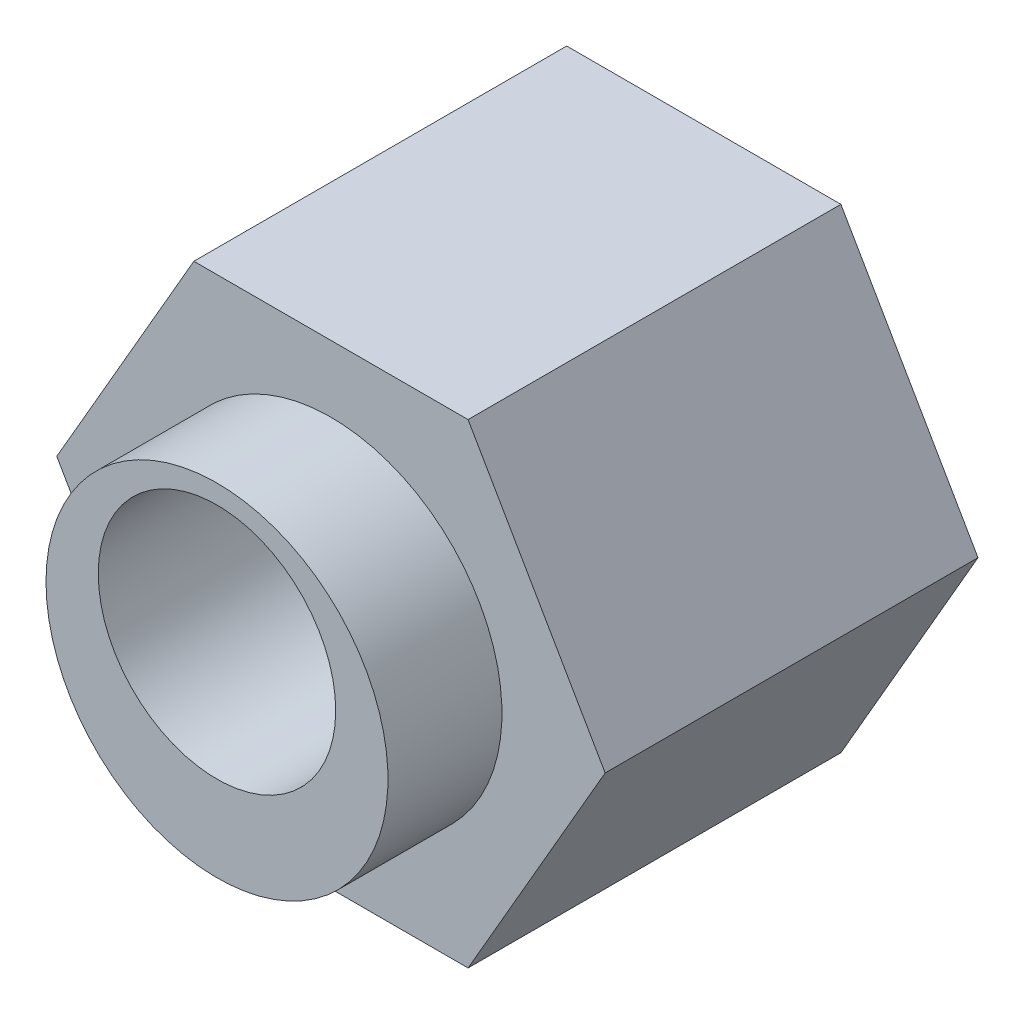
ISO-10303-21;
HEADER;
FILE_DESCRIPTION(('STEP AP214'),'2;1');
FILE_NAME('part.step','',(''),(''),'','','');
FILE_SCHEMA(('AUTOMOTIVE_DESIGN { 1 0 10303 214 1 1 1 1 }'));
ENDSEC;
DATA;
#1=APPLICATION_CONTEXT('core data for automotive mechanical design processes');
#2=APPLICATION_PROTOCOL_DEFINITION('international standard','automotive_design',2000,#1);
#3=PRODUCT_CONTEXT('',#1,'mechanical');
#4=PRODUCT('Part','Part','',(#3));
#5=PRODUCT_RELATED_PRODUCT_CATEGORY('part','',(#4));
#6=PRODUCT_DEFINITION_FORMATION('','',#4);
#7=PRODUCT_DEFINITION_CONTEXT('part definition',#1,'design');
#8=PRODUCT_DEFINITION('design','',#6,#7);
#9=PRODUCT_DEFINITION_SHAPE('','',#8);
#10=(LENGTH_UNIT() NAMED_UNIT(*) SI_UNIT(.MILLI.,.METRE.));
#11=(NAMED_UNIT(*) PLANE_ANGLE_UNIT() SI_UNIT($,.RADIAN.));
#12=(NAMED_UNIT(*) SI_UNIT($,.STERADIAN.) SOLID_ANGLE_UNIT());
#13=UNCERTAINTY_MEASURE_WITH_UNIT(LENGTH_MEASURE(1.E-05),#10,'distance_accuracy_value','');
#14=(GEOMETRIC_REPRESENTATION_CONTEXT(3) GLOBAL_UNCERTAINTY_ASSIGNED_CONTEXT((#13)) GLOBAL_UNIT_ASSIGNED_CONTEXT((#10,
#11,#12)) REPRESENTATION_CONTEXT('',''));
#15=CARTESIAN_POINT('',(0.,0.,0.));
#16=DIRECTION('',(0.,0.,1.));
#17=DIRECTION('',(1.,0.,0.));
#18=AXIS2_PLACEMENT_3D('',#15,#16,#17);
#19=CARTESIAN_POINT('',(0.,0.7,0.45));
#20=DIRECTION('',(0.,0.,-1.));
#21=DIRECTION('',(-1.,0.,0.));
#22=AXIS2_PLACEMENT_3D('',#19,#20,#21);
#23=PLANE('',#22);
#24=CARTESIAN_POINT('',(0.,0.7,0.45));
#25=DIRECTION('',(0.,0.,-1.));
#26=DIRECTION('',(-1.,0.,0.));
#27=AXIS2_PLACEMENT_3D('',#24,#25,#26);
#28=CIRCLE('',#27,3.6);
#29=CARTESIAN_POINT('',(-3.6,0.7,0.45));
#30=VERTEX_POINT('',#29);
#31=EDGE_CURVE('E19',#30,#30,#28,.T.);
#32=ORIENTED_EDGE('',*,*,#31,.F.);
#33=EDGE_LOOP('',(#32));
#34=FACE_BOUND('',#33,.T.);
#35=DIRECTION('',(0.5,-0.866025403784439,0.));
#36=VECTOR('',#35,1.);
#37=CARTESIAN_POINT('',(-5.77350269189626,0.,0.45));
#38=LINE('',#37,#36);
#39=CARTESIAN_POINT('',(-5.77350269189626,0.,0.45));
#40=VERTEX_POINT('',#39);
#41=CARTESIAN_POINT('',(-2.88675134594813,-5.,0.45));
#42=VERTEX_POINT('',#41);
#43=EDGE_CURVE('E67',#40,#42,#38,.T.);
#44=ORIENTED_EDGE('',*,*,#43,.F.);
#45=DIRECTION('',(-0.500000000000001,-0.866025403784438,0.));
#46=VECTOR('',#45,1.);
#47=CARTESIAN_POINT('',(-2.88675134594812,5.,0.45));
#48=LINE('',#47,#46);
#49=CARTESIAN_POINT('',(-2.88675134594813,5.,0.45));
#50=VERTEX_POINT('',#49);
#51=EDGE_CURVE('E74',#50,#40,#48,.T.);
#52=ORIENTED_EDGE('',*,*,#51,.F.);
#53=DIRECTION('',(1.,0.,0.));
#54=VECTOR('',#53,1.);
#55=CARTESIAN_POINT('',(2.88675134594813,5.,0.45));
#56=LINE('',#55,#54);
#57=CARTESIAN_POINT('',(2.88675134594813,5.,0.45));
#58=VERTEX_POINT('',#57);
#59=EDGE_CURVE('E123',#58,#50,#56,.F.);
#60=ORIENTED_EDGE('',*,*,#59,.F.);
#61=DIRECTION('',(-0.5,0.866025403784439,0.));
#62=VECTOR('',#61,1.);
#63=CARTESIAN_POINT('',(5.77350269189626,0.,0.45));
#64=LINE('',#63,#62);
#65=CARTESIAN_POINT('',(5.77350269189626,0.,0.45));
#66=VERTEX_POINT('',#65);
#67=EDGE_CURVE('E128',#66,#58,#64,.T.);
#68=ORIENTED_EDGE('',*,*,#67,.F.);
#69=DIRECTION('',(0.500000000000001,0.866025403784438,0.));
#70=VECTOR('',#69,1.);
#71=CARTESIAN_POINT('',(2.88675134594812,-5.,0.45));
#72=LINE('',#71,#70);
#73=CARTESIAN_POINT('',(2.88675134594813,-5.,0.45));
#74=VERTEX_POINT('',#73);
#75=EDGE_CURVE('E133',#74,#66,#72,.T.);
#76=ORIENTED_EDGE('',*,*,#75,.F.);
#77=DIRECTION('',(1.,0.,0.));
#78=VECTOR('',#77,1.);
#79=CARTESIAN_POINT('',(-2.88675134594813,-5.,0.45));
#80=LINE('',#79,#78);
#81=EDGE_CURVE('E88',#42,#74,#80,.T.);
#82=ORIENTED_EDGE('',*,*,#81,.F.);
#83=EDGE_LOOP('',(#44,#52,#60,#68,#76,#82));
#84=FACE_BOUND('',#83,.T.);
#85=ADVANCED_FACE('F16',(#34,#84),#23,.T.);
#86=CARTESIAN_POINT('',(0.,0.7,0.45));
#87=DIRECTION('',(0.,0.,-1.));
#88=DIRECTION('',(-1.,0.,0.));
#89=AXIS2_PLACEMENT_3D('',#86,#87,#88);
#90=CYLINDRICAL_SURFACE('',#89,3.6);
#91=ORIENTED_EDGE('',*,*,#31,.T.);
#92=EDGE_LOOP('',(#91));
#93=FACE_BOUND('',#92,.T.);
#94=CARTESIAN_POINT('',(0.,0.7,0.0500000000442924));
#95=DIRECTION('',(0.,0.,1.));
#96=DIRECTION('',(1.,0.,0.));
#97=AXIS2_PLACEMENT_3D('',#94,#95,#96);
#98=CIRCLE('',#97,3.60000000000582);
#99=CARTESIAN_POINT('',(3.60000000000582,0.7,0.0500000000442924));
#100=VERTEX_POINT('',#99);
#101=EDGE_CURVE('E94',#100,#100,#98,.F.);
#102=ORIENTED_EDGE('',*,*,#101,.F.);
#103=EDGE_LOOP('',(#102));
#104=FACE_BOUND('',#103,.T.);
#105=ADVANCED_FACE('F273',(#93,#104),#90,.T.);
#106=CARTESIAN_POINT('',(-2.88675134594812,5.,-0.0499999999999997));
#107=DIRECTION('',(-0.866025403784438,0.500000000000001,0.));
#108=DIRECTION('',(-0.500000000000001,-0.866025403784438,0.));
#109=AXIS2_PLACEMENT_3D('',#106,#107,#108);
#110=PLANE('',#109);
#111=DIRECTION('',(0.,0.,1.));
#112=VECTOR('',#111,1.);
#113=CARTESIAN_POINT('',(-5.77350269189626,0.,-0.0499999999999997));
#114=LINE('',#113,#112);
#115=CARTESIAN_POINT('',(-5.77350269189626,0.,8.3));
#116=VERTEX_POINT('',#115);
#117=EDGE_CURVE('E77',#116,#40,#114,.F.);
#118=ORIENTED_EDGE('',*,*,#117,.F.);
#119=DIRECTION('',(-0.500000000000001,-0.866025403784438,0.));
#120=VECTOR('',#119,1.);
#121=CARTESIAN_POINT('',(-2.88675134594812,5.,8.3));
#122=LINE('',#121,#120);
#123=CARTESIAN_POINT('',(-2.88675134594813,5.,8.3));
#124=VERTEX_POINT('',#123);
#125=EDGE_CURVE('E96',#124,#116,#122,.T.);
#126=ORIENTED_EDGE('',*,*,#125,.F.);
#127=DIRECTION('',(0.,0.,1.));
#128=VECTOR('',#127,1.);
#129=CARTESIAN_POINT('',(-2.88675134594813,5.,-0.0499999999999997));
#130=LINE('',#129,#128);
#131=EDGE_CURVE('E79',#50,#124,#130,.T.);
#132=ORIENTED_EDGE('',*,*,#131,.F.);
#133=ORIENTED_EDGE('',*,*,#51,.T.);
#134=EDGE_LOOP('',(#118,#126,#132,#133));
#135=FACE_BOUND('',#134,.T.);
#136=ADVANCED_FACE('F75',(#135),#110,.T.);
#137=CARTESIAN_POINT('',(-5.77350269189626,0.,-0.0499999999999997));
#138=DIRECTION('',(-0.866025403784439,-0.5,0.));
#139=DIRECTION('',(0.5,-0.866025403784439,0.));
#140=AXIS2_PLACEMENT_3D('',#137,#138,#139);
#141=PLANE('',#140);
#142=DIRECTION('',(0.,0.,-1.));
#143=VECTOR('',#142,1.);
#144=CARTESIAN_POINT('',(-2.88675134594813,-5.,-0.0499999999999997));
#145=LINE('',#144,#143);
#146=CARTESIAN_POINT('',(-2.88675134594813,-5.,8.3));
#147=VERTEX_POINT('',#146);
#148=EDGE_CURVE('E89',#147,#42,#145,.T.);
#149=ORIENTED_EDGE('',*,*,#148,.F.);
#150=DIRECTION('',(0.5,-0.866025403784439,0.));
#151=VECTOR('',#150,1.);
#152=CARTESIAN_POINT('',(-5.77350269189626,0.,8.3));
#153=LINE('',#152,#151);
#154=EDGE_CURVE('E84',#116,#147,#153,.T.);
#155=ORIENTED_EDGE('',*,*,#154,.F.);
#156=ORIENTED_EDGE('',*,*,#117,.T.);
#157=ORIENTED_EDGE('',*,*,#43,.T.);
#158=EDGE_LOOP('',(#149,#155,#156,#157));
#159=FACE_BOUND('',#158,.T.);
#160=ADVANCED_FACE('F83',(#159),#141,.T.);
#161=CARTESIAN_POINT('',(-2.88675134594813,-5.,-0.0499999999999997));
#162=DIRECTION('',(0.,-1.,0.));
#163=DIRECTION('',(0.,0.,-1.));
#164=AXIS2_PLACEMENT_3D('',#161,#162,#163);
#165=PLANE('',#164);
#166=DIRECTION('',(0.,0.,1.));
#167=VECTOR('',#166,1.);
#168=CARTESIAN_POINT('',(2.88675134594812,-5.,-0.0499999999999997));
#169=LINE('',#168,#167);
#170=CARTESIAN_POINT('',(2.88675134594813,-5.,8.3));
#171=VERTEX_POINT('',#170);
#172=EDGE_CURVE('E135',#171,#74,#169,.F.);
#173=ORIENTED_EDGE('',*,*,#172,.F.);
#174=DIRECTION('',(1.,0.,0.));
#175=VECTOR('',#174,1.);
#176=CARTESIAN_POINT('',(0.,-5.,8.3));
#177=LINE('',#176,#175);
#178=EDGE_CURVE('E118',#147,#171,#177,.T.);
#179=ORIENTED_EDGE('',*,*,#178,.F.);
#180=ORIENTED_EDGE('',*,*,#148,.T.);
#181=ORIENTED_EDGE('',*,*,#81,.T.);
#182=EDGE_LOOP('',(#173,#179,#180,#181));
#183=FACE_BOUND('',#182,.T.);
#184=ADVANCED_FACE('F139',(#183),#165,.T.);
#185=CARTESIAN_POINT('',(2.88675134594812,-5.,-0.0499999999999997));
#186=DIRECTION('',(0.866025403784438,-0.500000000000001,0.));
#187=DIRECTION('',(0.500000000000001,0.866025403784438,0.));
#188=AXIS2_PLACEMENT_3D('',#185,#186,#187);
#189=PLANE('',#188);
#190=DIRECTION('',(0.,0.,1.));
#191=VECTOR('',#190,1.);
#192=CARTESIAN_POINT('',(5.77350269189626,0.,-0.0499999999999997));
#193=LINE('',#192,#191);
#194=CARTESIAN_POINT('',(5.77350269189626,0.,8.3));
#195=VERTEX_POINT('',#194);
#196=EDGE_CURVE('E130',#195,#66,#193,.F.);
#197=ORIENTED_EDGE('',*,*,#196,.F.);
#198=DIRECTION('',(0.500000000000001,0.866025403784438,0.));
#199=VECTOR('',#198,1.);
#200=CARTESIAN_POINT('',(2.88675134594812,-5.,8.3));
#201=LINE('',#200,#199);
#202=EDGE_CURVE('E113',#171,#195,#201,.T.);
#203=ORIENTED_EDGE('',*,*,#202,.F.);
#204=ORIENTED_EDGE('',*,*,#172,.T.);
#205=ORIENTED_EDGE('',*,*,#75,.T.);
#206=EDGE_LOOP('',(#197,#203,#204,#205));
#207=FACE_BOUND('',#206,.T.);
#208=ADVANCED_FACE('F144',(#207),#189,.T.);
#209=CARTESIAN_POINT('',(5.77350269189626,0.,-0.0499999999999997));
#210=DIRECTION('',(0.866025403784439,0.5,0.));
#211=DIRECTION('',(-0.5,0.866025403784439,0.));
#212=AXIS2_PLACEMENT_3D('',#209,#210,#211);
#213=PLANE('',#212);
#214=DIRECTION('',(0.,0.,1.));
#215=VECTOR('',#214,1.);
#216=CARTESIAN_POINT('',(2.88675134594813,5.,-0.0499999999999997));
#217=LINE('',#216,#215);
#218=CARTESIAN_POINT('',(2.88675134594813,5.,8.3));
#219=VERTEX_POINT('',#218);
#220=EDGE_CURVE('E125',#219,#58,#217,.F.);
#221=ORIENTED_EDGE('',*,*,#220,.F.);
#222=DIRECTION('',(-0.5,0.866025403784439,0.));
#223=VECTOR('',#222,1.);
#224=CARTESIAN_POINT('',(5.77350269189626,0.,8.3));
#225=LINE('',#224,#223);
#226=EDGE_CURVE('E34',#195,#219,#225,.T.);
#227=ORIENTED_EDGE('',*,*,#226,.F.);
#228=ORIENTED_EDGE('',*,*,#196,.T.);
#229=ORIENTED_EDGE('',*,*,#67,.T.);
#230=EDGE_LOOP('',(#221,#227,#228,#229));
#231=FACE_BOUND('',#230,.T.);
#232=ADVANCED_FACE('F147',(#231),#213,.T.);
#233=CARTESIAN_POINT('',(2.88675134594813,5.,-0.0499999999999997));
#234=DIRECTION('',(0.,1.,0.));
#235=DIRECTION('',(0.,0.,1.));
#236=AXIS2_PLACEMENT_3D('',#233,#234,#235);
#237=PLANE('',#236);
#238=ORIENTED_EDGE('',*,*,#131,.T.);
#239=DIRECTION('',(1.,0.,0.));
#240=VECTOR('',#239,1.);
#241=CARTESIAN_POINT('',(0.,5.,8.3));
#242=LINE('',#241,#240);
#243=EDGE_CURVE('E108',#219,#124,#242,.F.);
#244=ORIENTED_EDGE('',*,*,#243,.F.);
#245=ORIENTED_EDGE('',*,*,#220,.T.);
#246=ORIENTED_EDGE('',*,*,#59,.T.);
#247=EDGE_LOOP('',(#238,#244,#245,#246));
#248=FACE_BOUND('',#247,.T.);
#249=ADVANCED_FACE('F149',(#248),#237,.T.);
#250=CARTESIAN_POINT('',(0.,0.7,0.0500000000442924));
#251=DIRECTION('',(0.,0.,1.));
#252=DIRECTION('',(1.,0.,0.));
#253=AXIS2_PLACEMENT_3D('',#250,#251,#252);
#254=CONICAL_SURFACE('',#253,3.60000000000582,0.785398163397448);
#255=CARTESIAN_POINT('',(0.,0.7,-0.049999999987449));
#256=DIRECTION('',(0.,0.,1.));
#257=DIRECTION('',(1.,0.,0.));
#258=AXIS2_PLACEMENT_3D('',#255,#256,#257);
#259=CIRCLE('',#258,3.49999999997408);
#260=CARTESIAN_POINT('',(3.49999999997408,0.7,-0.049999999987449));
#261=VERTEX_POINT('',#260);
#262=EDGE_CURVE('E106',#261,#261,#259,.T.);
#263=ORIENTED_EDGE('',*,*,#262,.T.);
#264=EDGE_LOOP('',(#263));
#265=FACE_BOUND('',#264,.T.);
#266=ORIENTED_EDGE('',*,*,#101,.T.);
#267=EDGE_LOOP('',(#266));
#268=FACE_BOUND('',#267,.T.);
#269=ADVANCED_FACE('F151',(#265,#268),#254,.T.);
#270=CARTESIAN_POINT('',(0.,0.,8.3));
#271=DIRECTION('',(0.,0.,1.));
#272=DIRECTION('',(1.,0.,0.));
#273=AXIS2_PLACEMENT_3D('',#270,#271,#272);
#274=PLANE('',#273);
#275=ORIENTED_EDGE('',*,*,#226,.T.);
#276=ORIENTED_EDGE('',*,*,#243,.T.);
#277=ORIENTED_EDGE('',*,*,#125,.T.);
#278=ORIENTED_EDGE('',*,*,#154,.T.);
#279=ORIENTED_EDGE('',*,*,#178,.T.);
#280=ORIENTED_EDGE('',*,*,#202,.T.);
#281=EDGE_LOOP('',(#275,#276,#277,#278,#279,#280));
#282=FACE_BOUND('',#281,.T.);
#283=CARTESIAN_POINT('',(0.,0.,8.3));
#284=DIRECTION('',(0.,0.,-1.));
#285=DIRECTION('',(-1.,0.,0.));
#286=AXIS2_PLACEMENT_3D('',#283,#284,#285);
#287=CIRCLE('',#286,3.6);
#288=CARTESIAN_POINT('',(-3.6,0.,8.3));
#289=VERTEX_POINT('',#288);
#290=EDGE_CURVE('E104',#289,#289,#287,.F.);
#291=ORIENTED_EDGE('',*,*,#290,.F.);
#292=EDGE_LOOP('',(#291));
#293=FACE_BOUND('',#292,.T.);
#294=ADVANCED_FACE('F158',(#282,#293),#274,.T.);
#295=CARTESIAN_POINT('',(0.,0.,-0.0499999999999997));
#296=DIRECTION('',(0.,0.,1.));
#297=DIRECTION('',(1.,0.,0.));
#298=AXIS2_PLACEMENT_3D('',#295,#296,#297);
#299=PLANE('',#298);
#300=ORIENTED_EDGE('',*,*,#262,.F.);
#301=EDGE_LOOP('',(#300));
#302=FACE_BOUND('',#301,.T.);
#303=CARTESIAN_POINT('',(0.,0.7,-0.0500000000442924));
#304=DIRECTION('',(0.,0.,-1.));
#305=DIRECTION('',(-1.,0.,0.));
#306=AXIS2_PLACEMENT_3D('',#303,#304,#305);
#307=CIRCLE('',#306,2.59999999997262);
#308=CARTESIAN_POINT('',(-2.59999999997262,0.7,-0.0500000000442924));
#309=VERTEX_POINT('',#308);
#310=EDGE_CURVE('E101',#309,#309,#307,.F.);
#311=ORIENTED_EDGE('',*,*,#310,.T.);
#312=EDGE_LOOP('',(#311));
#313=FACE_BOUND('',#312,.T.);
#314=ADVANCED_FACE('F181',(#302,#313),#299,.F.);
#315=CARTESIAN_POINT('',(0.,0.,10.7));
#316=DIRECTION('',(0.,0.,-1.));
#317=DIRECTION('',(-1.,0.,0.));
#318=AXIS2_PLACEMENT_3D('',#315,#316,#317);
#319=CYLINDRICAL_SURFACE('',#318,3.6);
#320=CARTESIAN_POINT('',(0.,0.,10.7));
#321=DIRECTION('',(0.,0.,-1.));
#322=DIRECTION('',(-1.,0.,0.));
#323=AXIS2_PLACEMENT_3D('',#320,#321,#322);
#324=CIRCLE('',#323,3.6);
#325=CARTESIAN_POINT('',(-3.6,0.,10.7));
#326=VERTEX_POINT('',#325);
#327=EDGE_CURVE('E98',#326,#326,#324,.F.);
#328=ORIENTED_EDGE('',*,*,#327,.F.);
#329=EDGE_LOOP('',(#328));
#330=FACE_BOUND('',#329,.T.);
#331=ORIENTED_EDGE('',*,*,#290,.T.);
#332=EDGE_LOOP('',(#331));
#333=FACE_BOUND('',#332,.T.);
#334=ADVANCED_FACE('F177',(#330,#333),#319,.T.);
#335=CARTESIAN_POINT('',(0.,0.7,-0.0500000000442924));
#336=DIRECTION('',(0.,0.,-1.));
#337=DIRECTION('',(-1.,0.,0.));
#338=AXIS2_PLACEMENT_3D('',#335,#336,#337);
#339=CONICAL_SURFACE('',#338,2.59999999997262,0.785398163113231);
#340=ORIENTED_EDGE('',*,*,#310,.F.);
#341=EDGE_LOOP('',(#340));
#342=FACE_BOUND('',#341,.T.);
#343=CARTESIAN_POINT('',(0.,0.7,0.0499999999999971));
#344=DIRECTION('',(0.,0.,-1.));
#345=DIRECTION('',(-1.,0.,0.));
#346=AXIS2_PLACEMENT_3D('',#343,#344,#345);
#347=CIRCLE('',#346,2.49999999999999);
#348=CARTESIAN_POINT('',(-2.49999999999999,0.7,0.0499999999999971));
#349=VERTEX_POINT('',#348);
#350=EDGE_CURVE('E25',#349,#349,#347,.F.);
#351=ORIENTED_EDGE('',*,*,#350,.T.);
#352=EDGE_LOOP('',(#351));
#353=FACE_BOUND('',#352,.T.);
#354=ADVANCED_FACE('F169',(#342,#353),#339,.F.);
#355=CARTESIAN_POINT('',(3.6,0.,10.7));
#356=DIRECTION('',(0.,0.,1.));
#357=DIRECTION('',(1.,0.,0.));
#358=AXIS2_PLACEMENT_3D('',#355,#356,#357);
#359=PLANE('',#358);
#360=ORIENTED_EDGE('',*,*,#327,.T.);
#361=EDGE_LOOP('',(#360));
#362=FACE_BOUND('',#361,.T.);
#363=CARTESIAN_POINT('',(0.,0.7,10.7));
#364=DIRECTION('',(0.,0.,-1.));
#365=DIRECTION('',(-1.,0.,0.));
#366=AXIS2_PLACEMENT_3D('',#363,#364,#365);
#367=CIRCLE('',#366,2.49999999999999);
#368=CARTESIAN_POINT('',(-2.49999999999999,0.7,10.7));
#369=VERTEX_POINT('',#368);
#370=EDGE_CURVE('E11',#369,#369,#367,.T.);
#371=ORIENTED_EDGE('',*,*,#370,.T.);
#372=EDGE_LOOP('',(#371));
#373=FACE_BOUND('',#372,.T.);
#374=ADVANCED_FACE('F163',(#362,#373),#359,.T.);
#375=CARTESIAN_POINT('',(0.,0.7,-0.0499999999999997));
#376=DIRECTION('',(0.,0.,-1.));
#377=DIRECTION('',(-1.,0.,0.));
#378=AXIS2_PLACEMENT_3D('',#375,#376,#377);
#379=CYLINDRICAL_SURFACE('',#378,2.49999999999999);
#380=ORIENTED_EDGE('',*,*,#350,.F.);
#381=EDGE_LOOP('',(#380));
#382=FACE_BOUND('',#381,.T.);
#383=ORIENTED_EDGE('',*,*,#370,.F.);
#384=EDGE_LOOP('',(#383));
#385=FACE_BOUND('',#384,.T.);
#386=ADVANCED_FACE('F161',(#382,#385),#379,.F.);
#387=CLOSED_SHELL('',(#85,#105,#136,#160,#184,#208,#232,#249,#269,#294,#314,#334,#354,#374,#386));
#388=MANIFOLD_SOLID_BREP('B1',#387);
#389=ADVANCED_BREP_SHAPE_REPRESENTATION('',(#18,#388),#14);
#390=SHAPE_DEFINITION_REPRESENTATION(#9,#389);
ENDSEC;
END-ISO-10303-21;
